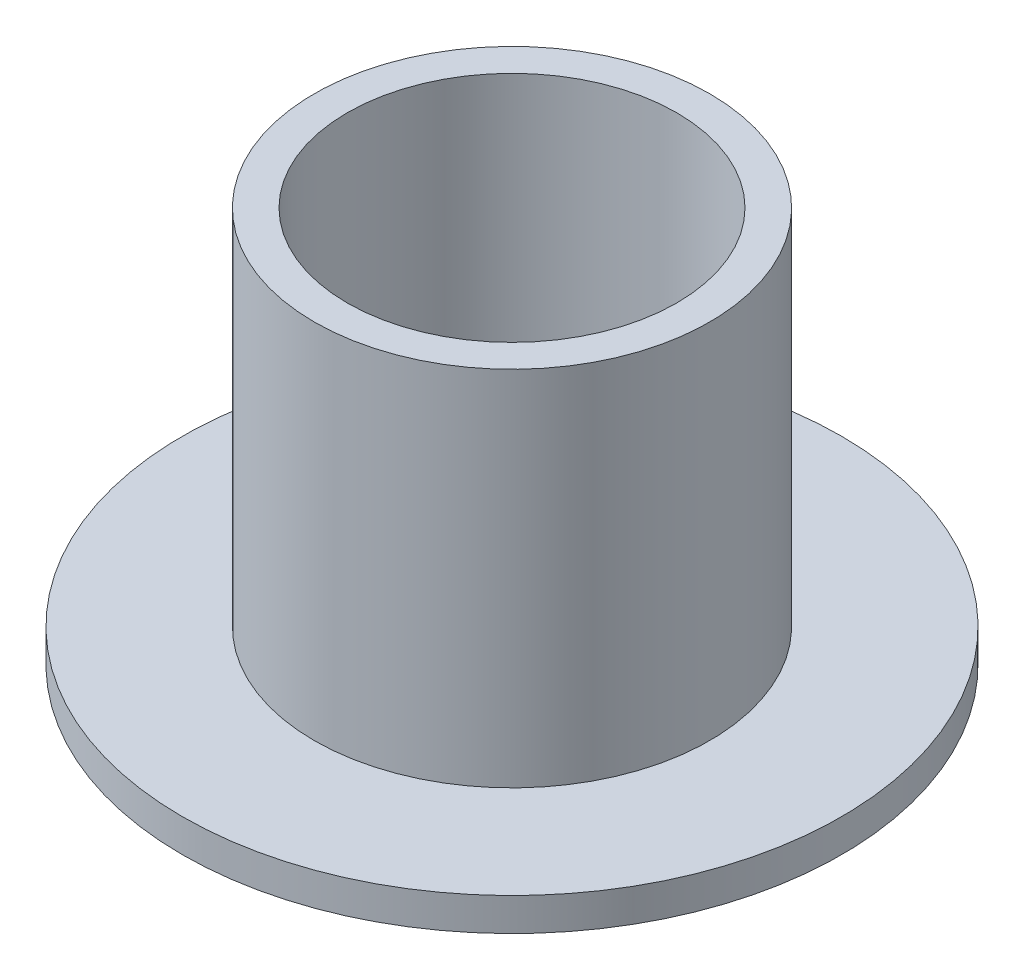
ISO-10303-21;
HEADER;
FILE_DESCRIPTION(('STEP AP214'),'2;1');
FILE_NAME('part.step','',(''),(''),'','','');
FILE_SCHEMA(('AUTOMOTIVE_DESIGN { 1 0 10303 214 1 1 1 1 }'));
ENDSEC;
DATA;
#1=APPLICATION_CONTEXT('core data for automotive mechanical design processes');
#2=APPLICATION_PROTOCOL_DEFINITION('international standard','automotive_design',2000,#1);
#3=PRODUCT_CONTEXT('',#1,'mechanical');
#4=PRODUCT('Part','Part','',(#3));
#5=PRODUCT_RELATED_PRODUCT_CATEGORY('part','',(#4));
#6=PRODUCT_DEFINITION_FORMATION('','',#4);
#7=PRODUCT_DEFINITION_CONTEXT('part definition',#1,'design');
#8=PRODUCT_DEFINITION('design','',#6,#7);
#9=PRODUCT_DEFINITION_SHAPE('','',#8);
#10=(LENGTH_UNIT() NAMED_UNIT(*) SI_UNIT(.MILLI.,.METRE.));
#11=(NAMED_UNIT(*) PLANE_ANGLE_UNIT() SI_UNIT($,.RADIAN.));
#12=(NAMED_UNIT(*) SI_UNIT($,.STERADIAN.) SOLID_ANGLE_UNIT());
#13=UNCERTAINTY_MEASURE_WITH_UNIT(LENGTH_MEASURE(1.E-05),#10,'distance_accuracy_value','');
#14=(GEOMETRIC_REPRESENTATION_CONTEXT(3) GLOBAL_UNCERTAINTY_ASSIGNED_CONTEXT((#13)) GLOBAL_UNIT_ASSIGNED_CONTEXT((#10,
#11,#12)) REPRESENTATION_CONTEXT('',''));
#15=CARTESIAN_POINT('',(0.,0.,0.));
#16=DIRECTION('',(0.,0.,1.));
#17=DIRECTION('',(1.,0.,0.));
#18=AXIS2_PLACEMENT_3D('',#15,#16,#17);
#19=CARTESIAN_POINT('',(0.,6.,0.));
#20=DIRECTION('',(0.,1.,0.));
#21=DIRECTION('',(0.,0.,1.));
#22=AXIS2_PLACEMENT_3D('',#19,#20,#21);
#23=PLANE('',#22);
#24=CARTESIAN_POINT('',(0.,6.,0.));
#25=DIRECTION('',(0.,1.,0.));
#26=DIRECTION('',(0.,0.,1.));
#27=AXIS2_PLACEMENT_3D('',#24,#25,#26);
#28=CIRCLE('',#27,3.);
#29=CARTESIAN_POINT('',(0.,6.,3.));
#30=VERTEX_POINT('',#29);
#31=EDGE_CURVE('E10',#30,#30,#28,.T.);
#32=ORIENTED_EDGE('',*,*,#31,.T.);
#33=EDGE_LOOP('',(#32));
#34=FACE_BOUND('',#33,.T.);
#35=CARTESIAN_POINT('',(0.,6.,0.));
#36=DIRECTION('',(0.,1.,0.));
#37=DIRECTION('',(0.,0.,1.));
#38=AXIS2_PLACEMENT_3D('',#35,#36,#37);
#39=CIRCLE('',#38,2.5);
#40=CARTESIAN_POINT('',(0.,6.,2.5));
#41=VERTEX_POINT('',#40);
#42=EDGE_CURVE('E44',#41,#41,#39,.T.);
#43=ORIENTED_EDGE('',*,*,#42,.F.);
#44=EDGE_LOOP('',(#43));
#45=FACE_BOUND('',#44,.T.);
#46=ADVANCED_FACE('F36',(#34,#45),#23,.T.);
#47=CARTESIAN_POINT('',(0.,0.,0.));
#48=DIRECTION('',(0.,1.,0.));
#49=DIRECTION('',(0.,0.,1.));
#50=AXIS2_PLACEMENT_3D('',#47,#48,#49);
#51=PLANE('',#50);
#52=CARTESIAN_POINT('',(0.,0.,0.));
#53=DIRECTION('',(0.,1.,0.));
#54=DIRECTION('',(0.,0.,1.));
#55=AXIS2_PLACEMENT_3D('',#52,#53,#54);
#56=CIRCLE('',#55,2.5);
#57=CARTESIAN_POINT('',(0.,0.,2.5));
#58=VERTEX_POINT('',#57);
#59=EDGE_CURVE('E49',#58,#58,#56,.T.);
#60=ORIENTED_EDGE('',*,*,#59,.T.);
#61=EDGE_LOOP('',(#60));
#62=FACE_BOUND('',#61,.T.);
#63=CARTESIAN_POINT('',(0.,0.,0.));
#64=DIRECTION('',(0.,1.,0.));
#65=DIRECTION('',(0.,0.,1.));
#66=AXIS2_PLACEMENT_3D('',#63,#64,#65);
#67=CIRCLE('',#66,5.);
#68=CARTESIAN_POINT('',(0.,0.,5.));
#69=VERTEX_POINT('',#68);
#70=EDGE_CURVE('E57',#69,#69,#67,.T.);
#71=ORIENTED_EDGE('',*,*,#70,.F.);
#72=EDGE_LOOP('',(#71));
#73=FACE_BOUND('',#72,.T.);
#74=ADVANCED_FACE('F85',(#62,#73),#51,.F.);
#75=CARTESIAN_POINT('',(0.,6.,0.));
#76=DIRECTION('',(0.,-1.,0.));
#77=DIRECTION('',(0.,0.,-1.));
#78=AXIS2_PLACEMENT_3D('',#75,#76,#77);
#79=CYLINDRICAL_SURFACE('',#78,3.);
#80=CARTESIAN_POINT('',(0.,0.5,0.));
#81=DIRECTION('',(0.,1.,0.));
#82=DIRECTION('',(0.,0.,1.));
#83=AXIS2_PLACEMENT_3D('',#80,#81,#82);
#84=CIRCLE('',#83,3.);
#85=CARTESIAN_POINT('',(0.,0.5,3.));
#86=VERTEX_POINT('',#85);
#87=EDGE_CURVE('E61',#86,#86,#84,.T.);
#88=ORIENTED_EDGE('',*,*,#87,.T.);
#89=EDGE_LOOP('',(#88));
#90=FACE_BOUND('',#89,.T.);
#91=ORIENTED_EDGE('',*,*,#31,.F.);
#92=EDGE_LOOP('',(#91));
#93=FACE_BOUND('',#92,.T.);
#94=ADVANCED_FACE('F38',(#90,#93),#79,.T.);
#95=CARTESIAN_POINT('',(0.,6.,0.));
#96=DIRECTION('',(0.,-1.,0.));
#97=DIRECTION('',(0.,0.,-1.));
#98=AXIS2_PLACEMENT_3D('',#95,#96,#97);
#99=CYLINDRICAL_SURFACE('',#98,2.5);
#100=ORIENTED_EDGE('',*,*,#42,.T.);
#101=EDGE_LOOP('',(#100));
#102=FACE_BOUND('',#101,.T.);
#103=ORIENTED_EDGE('',*,*,#59,.F.);
#104=EDGE_LOOP('',(#103));
#105=FACE_BOUND('',#104,.T.);
#106=ADVANCED_FACE('F74',(#102,#105),#99,.F.);
#107=CARTESIAN_POINT('',(0.,0.5,0.));
#108=DIRECTION('',(0.,1.,0.));
#109=DIRECTION('',(0.,0.,1.));
#110=AXIS2_PLACEMENT_3D('',#107,#108,#109);
#111=PLANE('',#110);
#112=CARTESIAN_POINT('',(0.,0.5,0.));
#113=DIRECTION('',(0.,1.,0.));
#114=DIRECTION('',(0.,0.,1.));
#115=AXIS2_PLACEMENT_3D('',#112,#113,#114);
#116=CIRCLE('',#115,5.);
#117=CARTESIAN_POINT('',(0.,0.5,5.));
#118=VERTEX_POINT('',#117);
#119=EDGE_CURVE('E55',#118,#118,#116,.T.);
#120=ORIENTED_EDGE('',*,*,#119,.T.);
#121=EDGE_LOOP('',(#120));
#122=FACE_BOUND('',#121,.T.);
#123=ORIENTED_EDGE('',*,*,#87,.F.);
#124=EDGE_LOOP('',(#123));
#125=FACE_BOUND('',#124,.T.);
#126=ADVANCED_FACE('F71',(#122,#125),#111,.T.);
#127=CARTESIAN_POINT('',(0.,0.5,0.));
#128=DIRECTION('',(0.,-1.,0.));
#129=DIRECTION('',(0.,0.,-1.));
#130=AXIS2_PLACEMENT_3D('',#127,#128,#129);
#131=CYLINDRICAL_SURFACE('',#130,5.);
#132=ORIENTED_EDGE('',*,*,#119,.F.);
#133=EDGE_LOOP('',(#132));
#134=FACE_BOUND('',#133,.T.);
#135=ORIENTED_EDGE('',*,*,#70,.T.);
#136=EDGE_LOOP('',(#135));
#137=FACE_BOUND('',#136,.T.);
#138=ADVANCED_FACE('F73',(#134,#137),#131,.T.);
#139=CLOSED_SHELL('',(#46,#74,#94,#106,#126,#138));
#140=MANIFOLD_SOLID_BREP('B2',#139);
#141=ADVANCED_BREP_SHAPE_REPRESENTATION('',(#18,#140),#14);
#142=SHAPE_DEFINITION_REPRESENTATION(#9,#141);
ENDSEC;
END-ISO-10303-21;
